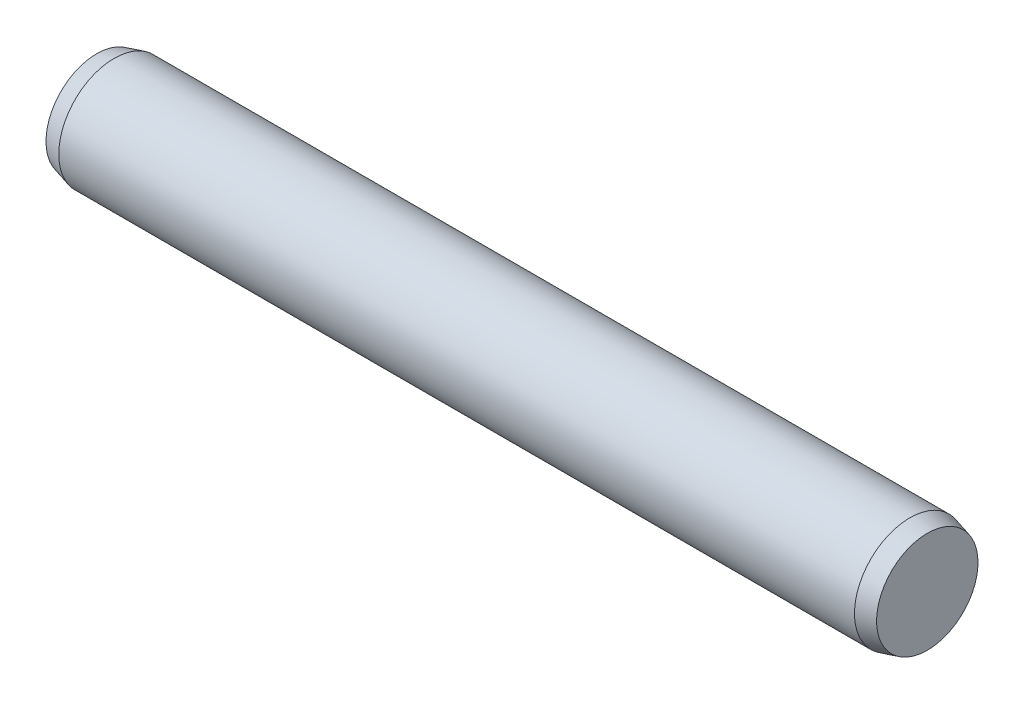
ISO-10303-21;
HEADER;
FILE_DESCRIPTION(('STEP AP214'),'2;1');
FILE_NAME('part.step','',(''),(''),'','','');
FILE_SCHEMA(('AUTOMOTIVE_DESIGN { 1 0 10303 214 1 1 1 1 }'));
ENDSEC;
DATA;
#1=APPLICATION_CONTEXT('core data for automotive mechanical design processes');
#2=APPLICATION_PROTOCOL_DEFINITION('international standard','automotive_design',2000,#1);
#3=PRODUCT_CONTEXT('',#1,'mechanical');
#4=PRODUCT('Part','Part','',(#3));
#5=PRODUCT_RELATED_PRODUCT_CATEGORY('part','',(#4));
#6=PRODUCT_DEFINITION_FORMATION('','',#4);
#7=PRODUCT_DEFINITION_CONTEXT('part definition',#1,'design');
#8=PRODUCT_DEFINITION('design','',#6,#7);
#9=PRODUCT_DEFINITION_SHAPE('','',#8);
#10=(LENGTH_UNIT() NAMED_UNIT(*) SI_UNIT(.MILLI.,.METRE.));
#11=(NAMED_UNIT(*) PLANE_ANGLE_UNIT() SI_UNIT($,.RADIAN.));
#12=(NAMED_UNIT(*) SI_UNIT($,.STERADIAN.) SOLID_ANGLE_UNIT());
#13=UNCERTAINTY_MEASURE_WITH_UNIT(LENGTH_MEASURE(1.E-05),#10,'distance_accuracy_value','');
#14=(GEOMETRIC_REPRESENTATION_CONTEXT(3) GLOBAL_UNCERTAINTY_ASSIGNED_CONTEXT((#13)) GLOBAL_UNIT_ASSIGNED_CONTEXT((#10,
#11,#12)) REPRESENTATION_CONTEXT('',''));
#15=CARTESIAN_POINT('',(0.,0.,0.));
#16=DIRECTION('',(0.,0.,1.));
#17=DIRECTION('',(1.,0.,0.));
#18=AXIS2_PLACEMENT_3D('',#15,#16,#17);
#19=CARTESIAN_POINT('',(-14.37,0.,0.));
#20=DIRECTION('',(1.,0.,0.));
#21=DIRECTION('',(0.,0.,-1.));
#22=AXIS2_PLACEMENT_3D('',#19,#20,#21);
#23=CYLINDRICAL_SURFACE('',#22,2.);
#24=CARTESIAN_POINT('',(-14.37,0.,0.));
#25=DIRECTION('',(-1.,0.,0.));
#26=DIRECTION('',(0.,0.,1.));
#27=AXIS2_PLACEMENT_3D('',#24,#25,#26);
#28=CIRCLE('',#27,2.);
#29=CARTESIAN_POINT('',(-14.37,0.,2.));
#30=VERTEX_POINT('',#29);
#31=EDGE_CURVE('E58',#30,#30,#28,.T.);
#32=ORIENTED_EDGE('',*,*,#31,.F.);
#33=EDGE_LOOP('',(#32));
#34=FACE_BOUND('',#33,.T.);
#35=CARTESIAN_POINT('',(14.37,0.,0.));
#36=DIRECTION('',(1.,0.,0.));
#37=DIRECTION('',(0.,0.,-1.));
#38=AXIS2_PLACEMENT_3D('',#35,#36,#37);
#39=CIRCLE('',#38,2.);
#40=CARTESIAN_POINT('',(14.37,0.,-2.));
#41=VERTEX_POINT('',#40);
#42=EDGE_CURVE('E10',#41,#41,#39,.T.);
#43=ORIENTED_EDGE('',*,*,#42,.F.);
#44=EDGE_LOOP('',(#43));
#45=FACE_BOUND('',#44,.T.);
#46=ADVANCED_FACE('F39',(#34,#45),#23,.T.);
#47=CARTESIAN_POINT('',(14.37,0.,0.));
#48=DIRECTION('',(-1.,0.,0.));
#49=DIRECTION('',(0.,0.,-1.));
#50=AXIS2_PLACEMENT_3D('',#47,#48,#49);
#51=CONICAL_SURFACE('',#50,2.,0.26179938779915);
#52=CARTESIAN_POINT('',(15.,0.,0.));
#53=DIRECTION('',(1.,0.,0.));
#54=DIRECTION('',(0.,0.,-1.));
#55=AXIS2_PLACEMENT_3D('',#52,#53,#54);
#56=CIRCLE('',#55,1.83119200876839);
#57=CARTESIAN_POINT('',(15.,0.,-1.83119200876839));
#58=VERTEX_POINT('',#57);
#59=EDGE_CURVE('E46',#58,#58,#56,.T.);
#60=ORIENTED_EDGE('',*,*,#59,.F.);
#61=EDGE_LOOP('',(#60));
#62=FACE_BOUND('',#61,.T.);
#63=ORIENTED_EDGE('',*,*,#42,.T.);
#64=EDGE_LOOP('',(#63));
#65=FACE_BOUND('',#64,.T.);
#66=ADVANCED_FACE('F70',(#62,#65),#51,.T.);
#67=CARTESIAN_POINT('',(15.,0.,0.));
#68=DIRECTION('',(1.,0.,0.));
#69=DIRECTION('',(0.,0.,-1.));
#70=AXIS2_PLACEMENT_3D('',#67,#68,#69);
#71=PLANE('',#70);
#72=ORIENTED_EDGE('',*,*,#59,.T.);
#73=EDGE_LOOP('',(#72));
#74=FACE_BOUND('',#73,.T.);
#75=ADVANCED_FACE('F74',(#74),#71,.T.);
#76=CARTESIAN_POINT('',(-14.37,0.,0.));
#77=DIRECTION('',(1.,0.,0.));
#78=DIRECTION('',(0.,0.,1.));
#79=AXIS2_PLACEMENT_3D('',#76,#77,#78);
#80=CONICAL_SURFACE('',#79,2.,0.26179938779915);
#81=CARTESIAN_POINT('',(-15.,0.,0.));
#82=DIRECTION('',(-1.,0.,0.));
#83=DIRECTION('',(0.,0.,1.));
#84=AXIS2_PLACEMENT_3D('',#81,#82,#83);
#85=CIRCLE('',#84,1.83119200876839);
#86=CARTESIAN_POINT('',(-15.,0.,1.83119200876839));
#87=VERTEX_POINT('',#86);
#88=EDGE_CURVE('E52',#87,#87,#85,.T.);
#89=ORIENTED_EDGE('',*,*,#88,.F.);
#90=EDGE_LOOP('',(#89));
#91=FACE_BOUND('',#90,.T.);
#92=ORIENTED_EDGE('',*,*,#31,.T.);
#93=EDGE_LOOP('',(#92));
#94=FACE_BOUND('',#93,.T.);
#95=ADVANCED_FACE('F66',(#91,#94),#80,.T.);
#96=CARTESIAN_POINT('',(-15.,0.,0.));
#97=DIRECTION('',(-1.,0.,0.));
#98=DIRECTION('',(0.,0.,1.));
#99=AXIS2_PLACEMENT_3D('',#96,#97,#98);
#100=PLANE('',#99);
#101=ORIENTED_EDGE('',*,*,#88,.T.);
#102=EDGE_LOOP('',(#101));
#103=FACE_BOUND('',#102,.T.);
#104=ADVANCED_FACE('F83',(#103),#100,.T.);
#105=CLOSED_SHELL('',(#46,#66,#75,#95,#104));
#106=MANIFOLD_SOLID_BREP('B2',#105);
#107=ADVANCED_BREP_SHAPE_REPRESENTATION('',(#18,#106),#14);
#108=SHAPE_DEFINITION_REPRESENTATION(#9,#107);
ENDSEC;
END-ISO-10303-21;
